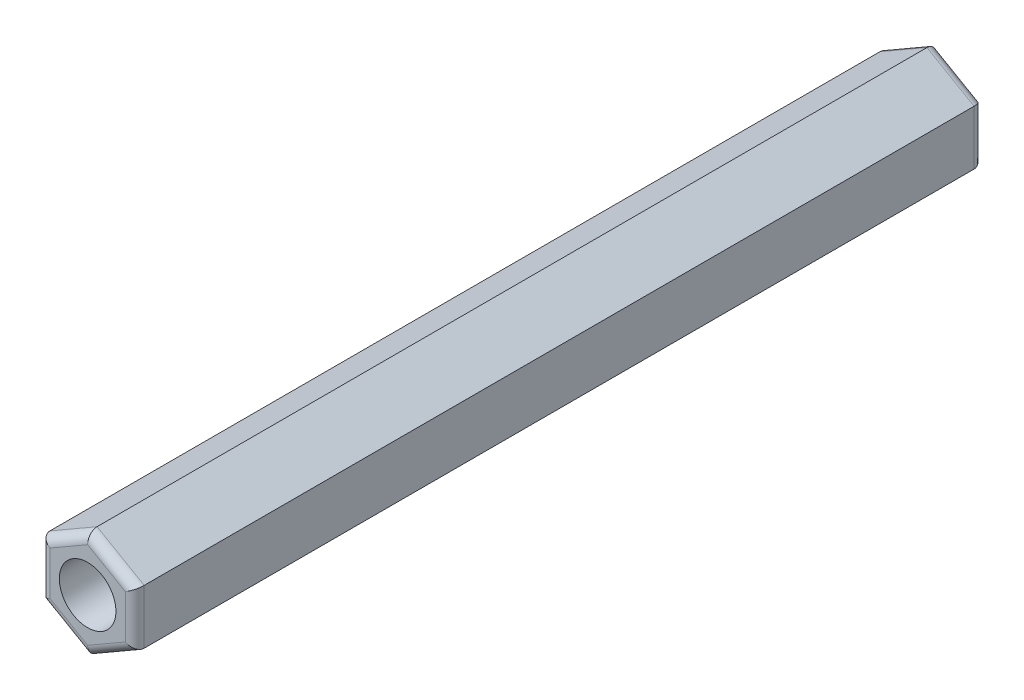
ISO-10303-21;
HEADER;
FILE_DESCRIPTION(('STEP AP214'),'2;1');
FILE_NAME('part.step','',(''),(''),'','','');
FILE_SCHEMA(('AUTOMOTIVE_DESIGN { 1 0 10303 214 1 1 1 1 }'));
ENDSEC;
DATA;
#1=APPLICATION_CONTEXT('core data for automotive mechanical design processes');
#2=APPLICATION_PROTOCOL_DEFINITION('international standard','automotive_design',2000,#1);
#3=PRODUCT_CONTEXT('',#1,'mechanical');
#4=PRODUCT('Part','Part','',(#3));
#5=PRODUCT_RELATED_PRODUCT_CATEGORY('part','',(#4));
#6=PRODUCT_DEFINITION_FORMATION('','',#4);
#7=PRODUCT_DEFINITION_CONTEXT('part definition',#1,'design');
#8=PRODUCT_DEFINITION('design','',#6,#7);
#9=PRODUCT_DEFINITION_SHAPE('','',#8);
#10=(LENGTH_UNIT() NAMED_UNIT(*) SI_UNIT(.MILLI.,.METRE.));
#11=(NAMED_UNIT(*) PLANE_ANGLE_UNIT() SI_UNIT($,.RADIAN.));
#12=(NAMED_UNIT(*) SI_UNIT($,.STERADIAN.) SOLID_ANGLE_UNIT());
#13=UNCERTAINTY_MEASURE_WITH_UNIT(LENGTH_MEASURE(1.E-05),#10,'distance_accuracy_value','');
#14=(GEOMETRIC_REPRESENTATION_CONTEXT(3) GLOBAL_UNCERTAINTY_ASSIGNED_CONTEXT((#13)) GLOBAL_UNIT_ASSIGNED_CONTEXT((#10,
#11,#12)) REPRESENTATION_CONTEXT('',''));
#15=CARTESIAN_POINT('',(0.,0.,0.));
#16=DIRECTION('',(0.,0.,1.));
#17=DIRECTION('',(1.,0.,0.));
#18=AXIS2_PLACEMENT_3D('',#15,#16,#17);
#19=CARTESIAN_POINT('',(-67.50212267549,1.44337567297406,45.));
#20=DIRECTION('',(1.,0.,0.));
#21=DIRECTION('',(0.,0.,-1.));
#22=AXIS2_PLACEMENT_3D('',#19,#20,#21);
#23=PLANE('',#22);
#24=DIRECTION('',(0.,0.,-1.));
#25=VECTOR('',#24,1.);
#26=CARTESIAN_POINT('',(-67.50212267549,-1.44337567297407,45.));
#27=LINE('',#26,#25);
#28=CARTESIAN_POINT('',(-67.50212267549,-1.44337567297407,44.5));
#29=VERTEX_POINT('',#28);
#30=CARTESIAN_POINT('',(-67.50212267549,-1.44337567297407,0.500000000000014));
#31=VERTEX_POINT('',#30);
#32=EDGE_CURVE('E153',#29,#31,#27,.T.);
#33=ORIENTED_EDGE('',*,*,#32,.T.);
#34=DIRECTION('',(0.,-1.,0.));
#35=VECTOR('',#34,1.);
#36=CARTESIAN_POINT('',(-67.50212267549,1.44337567297406,0.5));
#37=LINE('',#36,#35);
#38=CARTESIAN_POINT('',(-67.50212267549,1.44337567297406,0.500000000000014));
#39=VERTEX_POINT('',#38);
#40=EDGE_CURVE('E150',#31,#39,#37,.F.);
#41=ORIENTED_EDGE('',*,*,#40,.T.);
#42=DIRECTION('',(0.,0.,-1.));
#43=VECTOR('',#42,1.);
#44=CARTESIAN_POINT('',(-67.50212267549,1.44337567297406,45.));
#45=LINE('',#44,#43);
#46=CARTESIAN_POINT('',(-67.50212267549,1.44337567297406,44.5));
#47=VERTEX_POINT('',#46);
#48=EDGE_CURVE('E147',#47,#39,#45,.T.);
#49=ORIENTED_EDGE('',*,*,#48,.F.);
#50=DIRECTION('',(0.,-1.,0.));
#51=VECTOR('',#50,1.);
#52=CARTESIAN_POINT('',(-67.50212267549,-1.44337567297407,44.5));
#53=LINE('',#52,#51);
#54=EDGE_CURVE('E207',#47,#29,#53,.T.);
#55=ORIENTED_EDGE('',*,*,#54,.T.);
#56=EDGE_LOOP('',(#33,#41,#49,#55));
#57=FACE_BOUND('',#56,.T.);
#58=ADVANCED_FACE('F33',(#57),#23,.T.);
#59=CARTESIAN_POINT('',(-70.00212267549,2.88675134594811,45.));
#60=DIRECTION('',(0.5,0.866025403784439,0.));
#61=DIRECTION('',(-0.866025403784439,0.5,0.));
#62=AXIS2_PLACEMENT_3D('',#59,#60,#61);
#63=PLANE('',#62);
#64=ORIENTED_EDGE('',*,*,#48,.T.);
#65=DIRECTION('',(0.866025403784439,-0.5,0.));
#66=VECTOR('',#65,1.);
#67=CARTESIAN_POINT('',(-70.00212267549,2.88675134594811,0.5));
#68=LINE('',#67,#66);
#69=CARTESIAN_POINT('',(-70.00212267549,2.88675134594811,0.500000000000014));
#70=VERTEX_POINT('',#69);
#71=EDGE_CURVE('E192',#39,#70,#68,.F.);
#72=ORIENTED_EDGE('',*,*,#71,.T.);
#73=DIRECTION('',(0.,0.,-1.));
#74=VECTOR('',#73,1.);
#75=CARTESIAN_POINT('',(-70.00212267549,2.88675134594811,45.));
#76=LINE('',#75,#74);
#77=CARTESIAN_POINT('',(-70.00212267549,2.88675134594811,44.5));
#78=VERTEX_POINT('',#77);
#79=EDGE_CURVE('E256',#78,#70,#76,.T.);
#80=ORIENTED_EDGE('',*,*,#79,.F.);
#81=DIRECTION('',(0.866025403784439,-0.5,0.));
#82=VECTOR('',#81,1.);
#83=CARTESIAN_POINT('',(-67.50212267549,1.44337567297406,44.5));
#84=LINE('',#83,#82);
#85=EDGE_CURVE('E198',#78,#47,#84,.T.);
#86=ORIENTED_EDGE('',*,*,#85,.T.);
#87=EDGE_LOOP('',(#64,#72,#80,#86));
#88=FACE_BOUND('',#87,.T.);
#89=ADVANCED_FACE('F285',(#88),#63,.T.);
#90=CARTESIAN_POINT('',(-72.50212267549,1.44337567297405,45.));
#91=DIRECTION('',(-0.5,0.866025403784438,0.));
#92=DIRECTION('',(-0.866025403784439,-0.5,0.));
#93=AXIS2_PLACEMENT_3D('',#90,#91,#92);
#94=PLANE('',#93);
#95=ORIENTED_EDGE('',*,*,#79,.T.);
#96=DIRECTION('',(0.866025403784439,0.5,0.));
#97=VECTOR('',#96,1.);
#98=CARTESIAN_POINT('',(-72.50212267549,1.44337567297405,0.5));
#99=LINE('',#98,#97);
#100=CARTESIAN_POINT('',(-72.50212267549,1.44337567297405,0.500000000000014));
#101=VERTEX_POINT('',#100);
#102=EDGE_CURVE('E232',#70,#101,#99,.F.);
#103=ORIENTED_EDGE('',*,*,#102,.T.);
#104=DIRECTION('',(0.,0.,-1.));
#105=VECTOR('',#104,1.);
#106=CARTESIAN_POINT('',(-72.50212267549,1.44337567297405,45.));
#107=LINE('',#106,#105);
#108=CARTESIAN_POINT('',(-72.50212267549,1.44337567297405,44.5));
#109=VERTEX_POINT('',#108);
#110=EDGE_CURVE('E254',#109,#101,#107,.T.);
#111=ORIENTED_EDGE('',*,*,#110,.F.);
#112=DIRECTION('',(0.866025403784439,0.5,0.));
#113=VECTOR('',#112,1.);
#114=CARTESIAN_POINT('',(-70.00212267549,2.88675134594811,44.5));
#115=LINE('',#114,#113);
#116=EDGE_CURVE('E235',#109,#78,#115,.T.);
#117=ORIENTED_EDGE('',*,*,#116,.T.);
#118=EDGE_LOOP('',(#95,#103,#111,#117));
#119=FACE_BOUND('',#118,.T.);
#120=ADVANCED_FACE('F291',(#119),#94,.T.);
#121=CARTESIAN_POINT('',(-72.50212267549,-1.44337567297407,45.));
#122=DIRECTION('',(-1.,0.,0.));
#123=DIRECTION('',(0.,0.,1.));
#124=AXIS2_PLACEMENT_3D('',#121,#122,#123);
#125=PLANE('',#124);
#126=ORIENTED_EDGE('',*,*,#110,.T.);
#127=DIRECTION('',(0.,1.,0.));
#128=VECTOR('',#127,1.);
#129=CARTESIAN_POINT('',(-72.50212267549,-1.44337567297407,0.5));
#130=LINE('',#129,#128);
#131=CARTESIAN_POINT('',(-72.50212267549,-1.44337567297407,0.500000000000014));
#132=VERTEX_POINT('',#131);
#133=EDGE_CURVE('E202',#101,#132,#130,.F.);
#134=ORIENTED_EDGE('',*,*,#133,.T.);
#135=DIRECTION('',(0.,0.,-1.));
#136=VECTOR('',#135,1.);
#137=CARTESIAN_POINT('',(-72.50212267549,-1.44337567297407,45.));
#138=LINE('',#137,#136);
#139=CARTESIAN_POINT('',(-72.50212267549,-1.44337567297407,44.5));
#140=VERTEX_POINT('',#139);
#141=EDGE_CURVE('E251',#140,#132,#138,.T.);
#142=ORIENTED_EDGE('',*,*,#141,.F.);
#143=DIRECTION('',(0.,1.,0.));
#144=VECTOR('',#143,1.);
#145=CARTESIAN_POINT('',(-72.50212267549,1.44337567297405,44.5));
#146=LINE('',#145,#144);
#147=EDGE_CURVE('E227',#140,#109,#146,.T.);
#148=ORIENTED_EDGE('',*,*,#147,.T.);
#149=EDGE_LOOP('',(#126,#134,#142,#148));
#150=FACE_BOUND('',#149,.T.);
#151=ADVANCED_FACE('F342',(#150),#125,.T.);
#152=CARTESIAN_POINT('',(-70.00212267549,-2.88675134594813,45.));
#153=DIRECTION('',(-0.499999999999999,-0.866025403784439,0.));
#154=DIRECTION('',(0.866025403784439,-0.499999999999999,0.));
#155=AXIS2_PLACEMENT_3D('',#152,#153,#154);
#156=PLANE('',#155);
#157=ORIENTED_EDGE('',*,*,#141,.T.);
#158=DIRECTION('',(-0.866025403784439,0.499999999999999,0.));
#159=VECTOR('',#158,1.);
#160=CARTESIAN_POINT('',(-70.00212267549,-2.88675134594813,0.5));
#161=LINE('',#160,#159);
#162=CARTESIAN_POINT('',(-70.00212267549,-2.88675134594813,0.500000000000014));
#163=VERTEX_POINT('',#162);
#164=EDGE_CURVE('E200',#132,#163,#161,.F.);
#165=ORIENTED_EDGE('',*,*,#164,.T.);
#166=DIRECTION('',(0.,0.,-1.));
#167=VECTOR('',#166,1.);
#168=CARTESIAN_POINT('',(-70.00212267549,-2.88675134594813,45.));
#169=LINE('',#168,#167);
#170=CARTESIAN_POINT('',(-70.00212267549,-2.88675134594813,44.5));
#171=VERTEX_POINT('',#170);
#172=EDGE_CURVE('E248',#171,#163,#169,.T.);
#173=ORIENTED_EDGE('',*,*,#172,.F.);
#174=DIRECTION('',(-0.866025403784439,0.499999999999999,0.));
#175=VECTOR('',#174,1.);
#176=CARTESIAN_POINT('',(-72.50212267549,-1.44337567297407,44.5));
#177=LINE('',#176,#175);
#178=EDGE_CURVE('E197',#171,#140,#177,.T.);
#179=ORIENTED_EDGE('',*,*,#178,.T.);
#180=EDGE_LOOP('',(#157,#165,#173,#179));
#181=FACE_BOUND('',#180,.T.);
#182=ADVANCED_FACE('F281',(#181),#156,.T.);
#183=CARTESIAN_POINT('',(-67.50212267549,-1.44337567297407,45.));
#184=DIRECTION('',(0.500000000000001,-0.866025403784438,0.));
#185=DIRECTION('',(0.866025403784438,0.500000000000001,0.));
#186=AXIS2_PLACEMENT_3D('',#183,#184,#185);
#187=PLANE('',#186);
#188=ORIENTED_EDGE('',*,*,#172,.T.);
#189=DIRECTION('',(-0.866025403784438,-0.500000000000001,0.));
#190=VECTOR('',#189,1.);
#191=CARTESIAN_POINT('',(-67.50212267549,-1.44337567297407,0.5));
#192=LINE('',#191,#190);
#193=EDGE_CURVE('E212',#163,#31,#192,.F.);
#194=ORIENTED_EDGE('',*,*,#193,.T.);
#195=ORIENTED_EDGE('',*,*,#32,.F.);
#196=DIRECTION('',(-0.866025403784438,-0.500000000000001,0.));
#197=VECTOR('',#196,1.);
#198=CARTESIAN_POINT('',(-70.00212267549,-2.88675134594813,44.5));
#199=LINE('',#198,#197);
#200=EDGE_CURVE('E210',#29,#171,#199,.T.);
#201=ORIENTED_EDGE('',*,*,#200,.T.);
#202=EDGE_LOOP('',(#188,#194,#195,#201));
#203=FACE_BOUND('',#202,.T.);
#204=ADVANCED_FACE('F274',(#203),#187,.T.);
#205=CARTESIAN_POINT('',(0.,0.,45.));
#206=DIRECTION('',(0.,0.,-1.));
#207=DIRECTION('',(-1.,0.,0.));
#208=AXIS2_PLACEMENT_3D('',#205,#206,#207);
#209=PLANE('',#208);
#210=CARTESIAN_POINT('',(-70.00212267549,0.,45.));
#211=DIRECTION('',(0.,0.,1.));
#212=DIRECTION('',(1.,0.,0.));
#213=AXIS2_PLACEMENT_3D('',#210,#211,#212);
#214=CIRCLE('',#213,1.5);
#215=CARTESIAN_POINT('',(-68.50212267549,0.,45.));
#216=VERTEX_POINT('',#215);
#217=EDGE_CURVE('E259',#216,#216,#214,.T.);
#218=ORIENTED_EDGE('',*,*,#217,.F.);
#219=EDGE_LOOP('',(#218));
#220=FACE_BOUND('',#219,.T.);
#221=DIRECTION('',(0.866025403784439,-0.5,0.));
#222=VECTOR('',#221,1.);
#223=CARTESIAN_POINT('',(-70.25212267549,2.45373864405589,45.));
#224=LINE('',#223,#222);
#225=CARTESIAN_POINT('',(-68.00212267549,1.15470053837924,45.));
#226=VERTEX_POINT('',#225);
#227=CARTESIAN_POINT('',(-70.00212267549,2.30940107675849,45.));
#228=VERTEX_POINT('',#227);
#229=EDGE_CURVE('E57',#226,#228,#224,.F.);
#230=ORIENTED_EDGE('',*,*,#229,.T.);
#231=DIRECTION('',(0.866025403784439,0.5,0.));
#232=VECTOR('',#231,1.);
#233=CARTESIAN_POINT('',(-72.25212267549,1.01036297108183,45.));
#234=LINE('',#233,#232);
#235=CARTESIAN_POINT('',(-72.00212267549,1.15470053837923,45.));
#236=VERTEX_POINT('',#235);
#237=EDGE_CURVE('E11',#228,#236,#234,.F.);
#238=ORIENTED_EDGE('',*,*,#237,.T.);
#239=DIRECTION('',(0.,1.,0.));
#240=VECTOR('',#239,1.);
#241=CARTESIAN_POINT('',(-72.00212267549,-1.44337567297407,45.));
#242=LINE('',#241,#240);
#243=CARTESIAN_POINT('',(-72.00212267549,-1.15470053837925,45.));
#244=VERTEX_POINT('',#243);
#245=EDGE_CURVE('E42',#236,#244,#242,.F.);
#246=ORIENTED_EDGE('',*,*,#245,.T.);
#247=DIRECTION('',(-0.866025403784439,0.499999999999999,0.));
#248=VECTOR('',#247,1.);
#249=CARTESIAN_POINT('',(-69.75212267549,-2.45373864405591,45.));
#250=LINE('',#249,#248);
#251=CARTESIAN_POINT('',(-70.00212267549,-2.3094010767585,45.));
#252=VERTEX_POINT('',#251);
#253=EDGE_CURVE('E218',#244,#252,#250,.F.);
#254=ORIENTED_EDGE('',*,*,#253,.T.);
#255=DIRECTION('',(-0.866025403784438,-0.500000000000001,0.));
#256=VECTOR('',#255,1.);
#257=CARTESIAN_POINT('',(-67.75212267549,-1.01036297108185,45.));
#258=LINE('',#257,#256);
#259=CARTESIAN_POINT('',(-68.00212267549,-1.15470053837925,45.));
#260=VERTEX_POINT('',#259);
#261=EDGE_CURVE('E214',#252,#260,#258,.F.);
#262=ORIENTED_EDGE('',*,*,#261,.T.);
#263=DIRECTION('',(0.,-1.,0.));
#264=VECTOR('',#263,1.);
#265=CARTESIAN_POINT('',(-68.00212267549,1.44337567297406,45.));
#266=LINE('',#265,#264);
#267=EDGE_CURVE('E216',#260,#226,#266,.F.);
#268=ORIENTED_EDGE('',*,*,#267,.T.);
#269=EDGE_LOOP('',(#230,#238,#246,#254,#262,#268));
#270=FACE_BOUND('',#269,.T.);
#271=ADVANCED_FACE('F220',(#220,#270),#209,.F.);
#272=CARTESIAN_POINT('',(0.,0.,0.));
#273=DIRECTION('',(0.,0.,-1.));
#274=DIRECTION('',(-1.,0.,0.));
#275=AXIS2_PLACEMENT_3D('',#272,#273,#274);
#276=PLANE('',#275);
#277=CARTESIAN_POINT('',(-70.00212267549,0.,0.));
#278=DIRECTION('',(0.,0.,1.));
#279=DIRECTION('',(1.,0.,0.));
#280=AXIS2_PLACEMENT_3D('',#277,#278,#279);
#281=CIRCLE('',#280,1.5);
#282=CARTESIAN_POINT('',(-68.50212267549,0.,0.));
#283=VERTEX_POINT('',#282);
#284=EDGE_CURVE('E162',#283,#283,#281,.T.);
#285=ORIENTED_EDGE('',*,*,#284,.T.);
#286=EDGE_LOOP('',(#285));
#287=FACE_BOUND('',#286,.T.);
#288=DIRECTION('',(0.,1.,0.));
#289=VECTOR('',#288,1.);
#290=CARTESIAN_POINT('',(-72.00212267549,0.,0.));
#291=LINE('',#290,#289);
#292=CARTESIAN_POINT('',(-72.00212267549,-1.15470053837925,0.));
#293=VERTEX_POINT('',#292);
#294=CARTESIAN_POINT('',(-72.00212267549,1.15470053837923,0.));
#295=VERTEX_POINT('',#294);
#296=EDGE_CURVE('E242',#293,#295,#291,.T.);
#297=ORIENTED_EDGE('',*,*,#296,.T.);
#298=DIRECTION('',(0.866025403784439,0.5,0.));
#299=VECTOR('',#298,1.);
#300=CARTESIAN_POINT('',(-18.5005306688725,32.0438590854734,0.));
#301=LINE('',#300,#299);
#302=CARTESIAN_POINT('',(-70.00212267549,2.30940107675848,0.));
#303=VERTEX_POINT('',#302);
#304=EDGE_CURVE('E240',#295,#303,#301,.T.);
#305=ORIENTED_EDGE('',*,*,#304,.T.);
#306=DIRECTION('',(0.866025403784439,-0.5,0.));
#307=VECTOR('',#306,1.);
#308=CARTESIAN_POINT('',(-16.5005306688725,-28.5797574703356,0.));
#309=LINE('',#308,#307);
#310=CARTESIAN_POINT('',(-68.00212267549,1.15470053837924,0.));
#311=VERTEX_POINT('',#310);
#312=EDGE_CURVE('E131',#303,#311,#309,.T.);
#313=ORIENTED_EDGE('',*,*,#312,.T.);
#314=DIRECTION('',(0.,-1.,0.));
#315=VECTOR('',#314,1.);
#316=CARTESIAN_POINT('',(-68.00212267549,0.,0.));
#317=LINE('',#316,#315);
#318=CARTESIAN_POINT('',(-68.00212267549,-1.15470053837925,0.));
#319=VERTEX_POINT('',#318);
#320=EDGE_CURVE('E124',#311,#319,#317,.T.);
#321=ORIENTED_EDGE('',*,*,#320,.T.);
#322=DIRECTION('',(-0.866025403784438,-0.500000000000001,0.));
#323=VECTOR('',#322,1.);
#324=CARTESIAN_POINT('',(-16.5005306688726,28.5797574703357,0.));
#325=LINE('',#324,#323);
#326=CARTESIAN_POINT('',(-70.00212267549,-2.3094010767585,0.));
#327=VERTEX_POINT('',#326);
#328=EDGE_CURVE('E127',#319,#327,#325,.T.);
#329=ORIENTED_EDGE('',*,*,#328,.T.);
#330=DIRECTION('',(-0.866025403784439,0.499999999999999,0.));
#331=VECTOR('',#330,1.);
#332=CARTESIAN_POINT('',(-18.5005306688724,-32.0438590854733,0.));
#333=LINE('',#332,#331);
#334=EDGE_CURVE('E136',#327,#293,#333,.T.);
#335=ORIENTED_EDGE('',*,*,#334,.T.);
#336=EDGE_LOOP('',(#297,#305,#313,#321,#329,#335));
#337=FACE_BOUND('',#336,.T.);
#338=ADVANCED_FACE('F126',(#287,#337),#276,.T.);
#339=CARTESIAN_POINT('',(-16.5005306688726,28.5797574703357,0.5));
#340=DIRECTION('',(-0.866025403784438,-0.500000000000001,0.));
#341=DIRECTION('',(0.500000000000001,-0.866025403784438,0.));
#342=AXIS2_PLACEMENT_3D('',#339,#340,#341);
#343=CYLINDRICAL_SURFACE('',#342,0.5);
#344=CARTESIAN_POINT('',(-68.00212267549,-1.15470053837925,0.5));
#345=DIRECTION('',(-0.5,-0.866025403784439,0.));
#346=DIRECTION('',(-0.866025403784439,0.5,0.));
#347=AXIS2_PLACEMENT_3D('',#344,#345,#346);
#348=ELLIPSE('',#347,0.577350269189626,0.5);
#349=EDGE_CURVE('E142',#31,#319,#348,.F.);
#350=ORIENTED_EDGE('',*,*,#349,.F.);
#351=ORIENTED_EDGE('',*,*,#193,.F.);
#352=CARTESIAN_POINT('',(-70.00212267549,-2.3094010767585,0.5));
#353=DIRECTION('',(-1.,0.,0.));
#354=DIRECTION('',(0.,-1.,0.));
#355=AXIS2_PLACEMENT_3D('',#352,#353,#354);
#356=ELLIPSE('',#355,0.577350269189626,0.5);
#357=EDGE_CURVE('E145',#327,#163,#356,.T.);
#358=ORIENTED_EDGE('',*,*,#357,.F.);
#359=ORIENTED_EDGE('',*,*,#328,.F.);
#360=EDGE_LOOP('',(#350,#351,#358,#359));
#361=FACE_BOUND('',#360,.T.);
#362=ADVANCED_FACE('F140',(#361),#343,.T.);
#363=CARTESIAN_POINT('',(-18.5005306688724,-32.0438590854734,0.5));
#364=DIRECTION('',(-0.866025403784439,0.499999999999999,0.));
#365=DIRECTION('',(-0.499999999999999,-0.866025403784439,0.));
#366=AXIS2_PLACEMENT_3D('',#363,#364,#365);
#367=CYLINDRICAL_SURFACE('',#366,0.5);
#368=ORIENTED_EDGE('',*,*,#357,.T.);
#369=ORIENTED_EDGE('',*,*,#164,.F.);
#370=CARTESIAN_POINT('',(-72.00212267549,-1.15470053837926,0.5));
#371=DIRECTION('',(-0.500000000000001,0.866025403784438,0.));
#372=DIRECTION('',(-0.866025403784438,-0.500000000000001,0.));
#373=AXIS2_PLACEMENT_3D('',#370,#371,#372);
#374=ELLIPSE('',#373,0.577350269189626,0.5);
#375=EDGE_CURVE('E151',#293,#132,#374,.T.);
#376=ORIENTED_EDGE('',*,*,#375,.F.);
#377=ORIENTED_EDGE('',*,*,#334,.F.);
#378=EDGE_LOOP('',(#368,#369,#376,#377));
#379=FACE_BOUND('',#378,.T.);
#380=ADVANCED_FACE('F306',(#379),#367,.T.);
#381=CARTESIAN_POINT('',(-68.00212267549,0.,0.5));
#382=DIRECTION('',(0.,-1.,0.));
#383=DIRECTION('',(0.,0.,-1.));
#384=AXIS2_PLACEMENT_3D('',#381,#382,#383);
#385=CYLINDRICAL_SURFACE('',#384,0.5);
#386=ORIENTED_EDGE('',*,*,#349,.T.);
#387=ORIENTED_EDGE('',*,*,#320,.F.);
#388=CARTESIAN_POINT('',(-68.00212267549,1.15470053837924,0.5));
#389=DIRECTION('',(0.5,-0.866025403784438,0.));
#390=DIRECTION('',(-0.866025403784439,-0.5,0.));
#391=AXIS2_PLACEMENT_3D('',#388,#389,#390);
#392=ELLIPSE('',#391,0.577350269189626,0.5);
#393=EDGE_CURVE('E156',#39,#311,#392,.F.);
#394=ORIENTED_EDGE('',*,*,#393,.F.);
#395=ORIENTED_EDGE('',*,*,#40,.F.);
#396=EDGE_LOOP('',(#386,#387,#394,#395));
#397=FACE_BOUND('',#396,.T.);
#398=ADVANCED_FACE('F149',(#397),#385,.T.);
#399=CARTESIAN_POINT('',(-72.00212267549,0.,0.5));
#400=DIRECTION('',(0.,1.,0.));
#401=DIRECTION('',(0.,0.,1.));
#402=AXIS2_PLACEMENT_3D('',#399,#400,#401);
#403=CYLINDRICAL_SURFACE('',#402,0.5);
#404=ORIENTED_EDGE('',*,*,#375,.T.);
#405=ORIENTED_EDGE('',*,*,#133,.F.);
#406=CARTESIAN_POINT('',(-72.00212267549,1.15470053837923,0.5));
#407=DIRECTION('',(0.5,0.866025403784439,0.));
#408=DIRECTION('',(-0.866025403784439,0.5,0.));
#409=AXIS2_PLACEMENT_3D('',#406,#407,#408);
#410=ELLIPSE('',#409,0.577350269189626,0.5);
#411=EDGE_CURVE('E181',#295,#101,#410,.T.);
#412=ORIENTED_EDGE('',*,*,#411,.F.);
#413=ORIENTED_EDGE('',*,*,#296,.F.);
#414=EDGE_LOOP('',(#404,#405,#412,#413));
#415=FACE_BOUND('',#414,.T.);
#416=ADVANCED_FACE('F300',(#415),#403,.T.);
#417=CARTESIAN_POINT('',(-16.5005306688725,-28.5797574703356,0.5));
#418=DIRECTION('',(0.866025403784439,-0.5,0.));
#419=DIRECTION('',(0.5,0.866025403784439,0.));
#420=AXIS2_PLACEMENT_3D('',#417,#418,#419);
#421=CYLINDRICAL_SURFACE('',#420,0.5);
#422=ORIENTED_EDGE('',*,*,#393,.T.);
#423=ORIENTED_EDGE('',*,*,#312,.F.);
#424=CARTESIAN_POINT('',(-70.00212267549,2.30940107675848,0.5));
#425=DIRECTION('',(1.,0.,0.));
#426=DIRECTION('',(0.,-1.,0.));
#427=AXIS2_PLACEMENT_3D('',#424,#425,#426);
#428=ELLIPSE('',#427,0.577350269189626,0.5);
#429=EDGE_CURVE('E176',#70,#303,#428,.F.);
#430=ORIENTED_EDGE('',*,*,#429,.F.);
#431=ORIENTED_EDGE('',*,*,#71,.F.);
#432=EDGE_LOOP('',(#422,#423,#430,#431));
#433=FACE_BOUND('',#432,.T.);
#434=ADVANCED_FACE('F191',(#433),#421,.T.);
#435=CARTESIAN_POINT('',(-18.5005306688725,32.0438590854734,0.5));
#436=DIRECTION('',(0.866025403784439,0.5,0.));
#437=DIRECTION('',(-0.5,0.866025403784439,0.));
#438=AXIS2_PLACEMENT_3D('',#435,#436,#437);
#439=CYLINDRICAL_SURFACE('',#438,0.5);
#440=ORIENTED_EDGE('',*,*,#411,.T.);
#441=ORIENTED_EDGE('',*,*,#102,.F.);
#442=ORIENTED_EDGE('',*,*,#429,.T.);
#443=ORIENTED_EDGE('',*,*,#304,.F.);
#444=EDGE_LOOP('',(#440,#441,#442,#443));
#445=FACE_BOUND('',#444,.T.);
#446=ADVANCED_FACE('F295',(#445),#439,.T.);
#447=CARTESIAN_POINT('',(-67.75212267549,-1.01036297108185,44.5));
#448=DIRECTION('',(0.866025403784438,0.500000000000001,0.));
#449=DIRECTION('',(-0.500000000000001,0.866025403784438,0.));
#450=AXIS2_PLACEMENT_3D('',#447,#448,#449);
#451=CYLINDRICAL_SURFACE('',#450,0.5);
#452=CARTESIAN_POINT('',(-68.00212267549,-1.15470053837926,44.5));
#453=DIRECTION('',(0.5,0.866025403784439,0.));
#454=DIRECTION('',(0.866025403784439,-0.5,0.));
#455=AXIS2_PLACEMENT_3D('',#452,#453,#454);
#456=ELLIPSE('',#455,0.577350269189626,0.5);
#457=EDGE_CURVE('E169',#260,#29,#456,.T.);
#458=ORIENTED_EDGE('',*,*,#457,.F.);
#459=ORIENTED_EDGE('',*,*,#261,.F.);
#460=CARTESIAN_POINT('',(-70.00212267549,-2.3094010767585,44.5));
#461=DIRECTION('',(1.,0.,0.));
#462=DIRECTION('',(0.,1.,0.));
#463=AXIS2_PLACEMENT_3D('',#460,#461,#462);
#464=ELLIPSE('',#463,0.577350269189626,0.5);
#465=EDGE_CURVE('E37',#171,#252,#464,.F.);
#466=ORIENTED_EDGE('',*,*,#465,.F.);
#467=ORIENTED_EDGE('',*,*,#200,.F.);
#468=EDGE_LOOP('',(#458,#459,#466,#467));
#469=FACE_BOUND('',#468,.T.);
#470=ADVANCED_FACE('F35',(#469),#451,.T.);
#471=CARTESIAN_POINT('',(-69.75212267549,-2.45373864405591,44.5));
#472=DIRECTION('',(0.866025403784439,-0.499999999999999,0.));
#473=DIRECTION('',(0.499999999999999,0.866025403784439,0.));
#474=AXIS2_PLACEMENT_3D('',#471,#472,#473);
#475=CYLINDRICAL_SURFACE('',#474,0.5);
#476=ORIENTED_EDGE('',*,*,#465,.T.);
#477=ORIENTED_EDGE('',*,*,#253,.F.);
#478=CARTESIAN_POINT('',(-72.00212267549,-1.15470053837925,44.5));
#479=DIRECTION('',(0.500000000000001,-0.866025403784438,0.));
#480=DIRECTION('',(0.866025403784438,0.500000000000001,0.));
#481=AXIS2_PLACEMENT_3D('',#478,#479,#480);
#482=ELLIPSE('',#481,0.577350269189626,0.5);
#483=EDGE_CURVE('E167',#140,#244,#482,.F.);
#484=ORIENTED_EDGE('',*,*,#483,.F.);
#485=ORIENTED_EDGE('',*,*,#178,.F.);
#486=EDGE_LOOP('',(#476,#477,#484,#485));
#487=FACE_BOUND('',#486,.T.);
#488=ADVANCED_FACE('F224',(#487),#475,.T.);
#489=CARTESIAN_POINT('',(-68.00212267549,1.44337567297406,44.5));
#490=DIRECTION('',(0.,1.,0.));
#491=DIRECTION('',(0.,0.,1.));
#492=AXIS2_PLACEMENT_3D('',#489,#490,#491);
#493=CYLINDRICAL_SURFACE('',#492,0.5);
#494=ORIENTED_EDGE('',*,*,#457,.T.);
#495=ORIENTED_EDGE('',*,*,#54,.F.);
#496=CARTESIAN_POINT('',(-68.00212267549,1.15470053837924,44.5));
#497=DIRECTION('',(-0.5,0.866025403784438,0.));
#498=DIRECTION('',(0.866025403784439,0.5,0.));
#499=AXIS2_PLACEMENT_3D('',#496,#497,#498);
#500=ELLIPSE('',#499,0.577350269189626,0.5);
#501=EDGE_CURVE('E164',#226,#47,#500,.T.);
#502=ORIENTED_EDGE('',*,*,#501,.F.);
#503=ORIENTED_EDGE('',*,*,#267,.F.);
#504=EDGE_LOOP('',(#494,#495,#502,#503));
#505=FACE_BOUND('',#504,.T.);
#506=ADVANCED_FACE('F320',(#505),#493,.T.);
#507=CARTESIAN_POINT('',(-72.00212267549,-1.44337567297407,44.5));
#508=DIRECTION('',(0.,-1.,0.));
#509=DIRECTION('',(0.,0.,-1.));
#510=AXIS2_PLACEMENT_3D('',#507,#508,#509);
#511=CYLINDRICAL_SURFACE('',#510,0.5);
#512=ORIENTED_EDGE('',*,*,#483,.T.);
#513=ORIENTED_EDGE('',*,*,#245,.F.);
#514=CARTESIAN_POINT('',(-72.00212267549,1.15470053837923,44.5));
#515=DIRECTION('',(-0.5,-0.866025403784439,0.));
#516=DIRECTION('',(0.866025403784439,-0.5,0.));
#517=AXIS2_PLACEMENT_3D('',#514,#515,#516);
#518=ELLIPSE('',#517,0.577350269189626,0.5);
#519=EDGE_CURVE('E50',#109,#236,#518,.F.);
#520=ORIENTED_EDGE('',*,*,#519,.F.);
#521=ORIENTED_EDGE('',*,*,#147,.F.);
#522=EDGE_LOOP('',(#512,#513,#520,#521));
#523=FACE_BOUND('',#522,.T.);
#524=ADVANCED_FACE('F226',(#523),#511,.T.);
#525=CARTESIAN_POINT('',(-70.25212267549,2.45373864405589,44.5));
#526=DIRECTION('',(-0.866025403784439,0.5,0.));
#527=DIRECTION('',(-0.5,-0.866025403784439,0.));
#528=AXIS2_PLACEMENT_3D('',#525,#526,#527);
#529=CYLINDRICAL_SURFACE('',#528,0.5);
#530=ORIENTED_EDGE('',*,*,#501,.T.);
#531=ORIENTED_EDGE('',*,*,#85,.F.);
#532=CARTESIAN_POINT('',(-70.00212267549,2.30940107675849,44.5));
#533=DIRECTION('',(-1.,0.,0.));
#534=DIRECTION('',(0.,1.,0.));
#535=AXIS2_PLACEMENT_3D('',#532,#533,#534);
#536=ELLIPSE('',#535,0.577350269189626,0.5);
#537=EDGE_CURVE('E160',#228,#78,#536,.T.);
#538=ORIENTED_EDGE('',*,*,#537,.F.);
#539=ORIENTED_EDGE('',*,*,#229,.F.);
#540=EDGE_LOOP('',(#530,#531,#538,#539));
#541=FACE_BOUND('',#540,.T.);
#542=ADVANCED_FACE('F314',(#541),#529,.T.);
#543=CARTESIAN_POINT('',(-72.25212267549,1.01036297108183,44.5));
#544=DIRECTION('',(-0.866025403784439,-0.5,0.));
#545=DIRECTION('',(0.5,-0.866025403784439,0.));
#546=AXIS2_PLACEMENT_3D('',#543,#544,#545);
#547=CYLINDRICAL_SURFACE('',#546,0.5);
#548=ORIENTED_EDGE('',*,*,#519,.T.);
#549=ORIENTED_EDGE('',*,*,#237,.F.);
#550=ORIENTED_EDGE('',*,*,#537,.T.);
#551=ORIENTED_EDGE('',*,*,#116,.F.);
#552=EDGE_LOOP('',(#548,#549,#550,#551));
#553=FACE_BOUND('',#552,.T.);
#554=ADVANCED_FACE('F269',(#553),#547,.T.);
#555=CARTESIAN_POINT('',(-70.00212267549,0.,0.));
#556=DIRECTION('',(0.,0.,1.));
#557=DIRECTION('',(1.,0.,0.));
#558=AXIS2_PLACEMENT_3D('',#555,#556,#557);
#559=CYLINDRICAL_SURFACE('',#558,1.5);
#560=ORIENTED_EDGE('',*,*,#284,.F.);
#561=EDGE_LOOP('',(#560));
#562=FACE_BOUND('',#561,.T.);
#563=ORIENTED_EDGE('',*,*,#217,.T.);
#564=EDGE_LOOP('',(#563));
#565=FACE_BOUND('',#564,.T.);
#566=ADVANCED_FACE('F266',(#562,#565),#559,.F.);
#567=CLOSED_SHELL('',(#58,#89,#120,#151,#182,#204,#271,#338,#362,#380,#398,#416,#434,#446,#470,
#488,#506,#524,#542,#554,#566));
#568=MANIFOLD_SOLID_BREP('B2',#567);
#569=ADVANCED_BREP_SHAPE_REPRESENTATION('',(#18,#568),#14);
#570=SHAPE_DEFINITION_REPRESENTATION(#9,#569);
ENDSEC;
END-ISO-10303-21;
